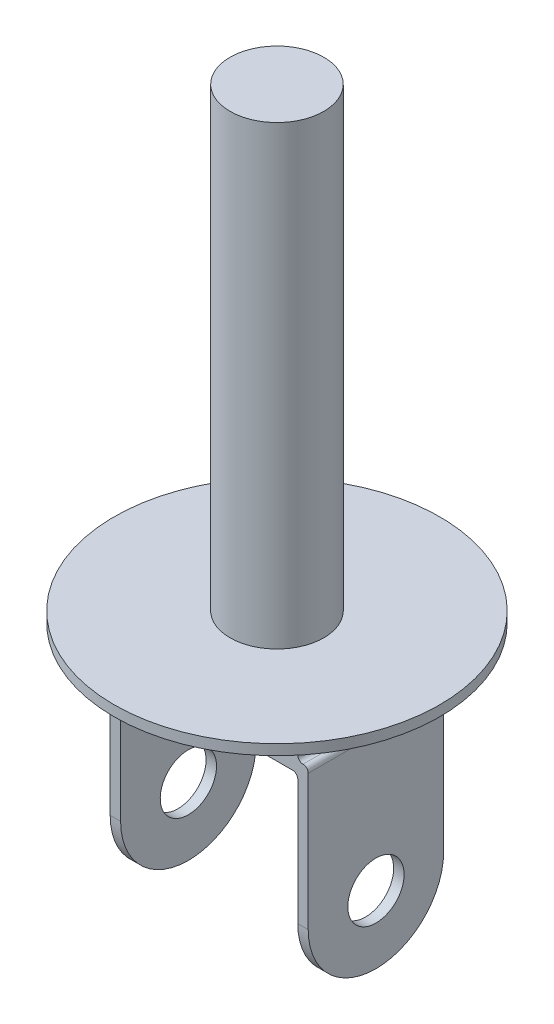
ISO-10303-21;
HEADER;
FILE_DESCRIPTION(('STEP AP214'),'2;1');
FILE_NAME('part.step','',(''),(''),'','','');
FILE_SCHEMA(('AUTOMOTIVE_DESIGN { 1 0 10303 214 1 1 1 1 }'));
ENDSEC;
DATA;
#1=APPLICATION_CONTEXT('core data for automotive mechanical design processes');
#2=APPLICATION_PROTOCOL_DEFINITION('international standard','automotive_design',2000,#1);
#3=PRODUCT_CONTEXT('',#1,'mechanical');
#4=PRODUCT('Part','Part','',(#3));
#5=PRODUCT_RELATED_PRODUCT_CATEGORY('part','',(#4));
#6=PRODUCT_DEFINITION_FORMATION('','',#4);
#7=PRODUCT_DEFINITION_CONTEXT('part definition',#1,'design');
#8=PRODUCT_DEFINITION('design','',#6,#7);
#9=PRODUCT_DEFINITION_SHAPE('','',#8);
#10=(LENGTH_UNIT() NAMED_UNIT(*) SI_UNIT(.MILLI.,.METRE.));
#11=(NAMED_UNIT(*) PLANE_ANGLE_UNIT() SI_UNIT($,.RADIAN.));
#12=(NAMED_UNIT(*) SI_UNIT($,.STERADIAN.) SOLID_ANGLE_UNIT());
#13=UNCERTAINTY_MEASURE_WITH_UNIT(LENGTH_MEASURE(1.E-05),#10,'distance_accuracy_value','');
#14=(GEOMETRIC_REPRESENTATION_CONTEXT(3) GLOBAL_UNCERTAINTY_ASSIGNED_CONTEXT((#13)) GLOBAL_UNIT_ASSIGNED_CONTEXT((#10,
#11,#12)) REPRESENTATION_CONTEXT('',''));
#15=CARTESIAN_POINT('',(0.,0.,0.));
#16=DIRECTION('',(0.,0.,1.));
#17=DIRECTION('',(1.,0.,0.));
#18=AXIS2_PLACEMENT_3D('',#15,#16,#17);
#19=CARTESIAN_POINT('',(-19.,-48.,-13.));
#20=DIRECTION('',(1.,0.,0.));
#21=DIRECTION('',(0.,0.,-1.));
#22=AXIS2_PLACEMENT_3D('',#19,#20,#21);
#23=PLANE('',#22);
#24=CARTESIAN_POINT('',(-19.,-35.,0.));
#25=DIRECTION('',(1.,0.,0.));
#26=DIRECTION('',(0.,0.,-1.));
#27=AXIS2_PLACEMENT_3D('',#24,#25,#26);
#28=CIRCLE('',#27,5.39999999999999);
#29=CARTESIAN_POINT('',(-19.,-35.,-5.39999999999999));
#30=VERTEX_POINT('',#29);
#31=EDGE_CURVE('E485',#30,#30,#28,.T.);
#32=ORIENTED_EDGE('',*,*,#31,.T.);
#33=EDGE_LOOP('',(#32));
#34=FACE_BOUND('',#33,.T.);
#35=DIRECTION('',(0.,1.,0.));
#36=VECTOR('',#35,1.);
#37=CARTESIAN_POINT('',(-19.,-48.,13.));
#38=LINE('',#37,#36);
#39=CARTESIAN_POINT('',(-19.,-35.,13.));
#40=VERTEX_POINT('',#39);
#41=CARTESIAN_POINT('',(-19.,-9.,13.));
#42=VERTEX_POINT('',#41);
#43=EDGE_CURVE('E234',#40,#42,#38,.T.);
#44=ORIENTED_EDGE('',*,*,#43,.T.);
#45=DIRECTION('',(0.,0.,-1.));
#46=VECTOR('',#45,1.);
#47=CARTESIAN_POINT('',(-19.,-9.,-13.));
#48=LINE('',#47,#46);
#49=CARTESIAN_POINT('',(-19.,-9.,-13.));
#50=VERTEX_POINT('',#49);
#51=EDGE_CURVE('E327',#42,#50,#48,.T.);
#52=ORIENTED_EDGE('',*,*,#51,.T.);
#53=DIRECTION('',(0.,1.,0.));
#54=VECTOR('',#53,1.);
#55=CARTESIAN_POINT('',(-19.,-48.,-13.));
#56=LINE('',#55,#54);
#57=CARTESIAN_POINT('',(-19.,-35.,-13.));
#58=VERTEX_POINT('',#57);
#59=EDGE_CURVE('E229',#58,#50,#56,.T.);
#60=ORIENTED_EDGE('',*,*,#59,.F.);
#61=CARTESIAN_POINT('',(-19.,-35.,0.));
#62=DIRECTION('',(1.,0.,0.));
#63=DIRECTION('',(0.,0.,-1.));
#64=AXIS2_PLACEMENT_3D('',#61,#62,#63);
#65=CIRCLE('',#64,13.);
#66=EDGE_CURVE('E437',#40,#58,#65,.T.);
#67=ORIENTED_EDGE('',*,*,#66,.F.);
#68=EDGE_LOOP('',(#44,#52,#60,#67));
#69=FACE_BOUND('',#68,.T.);
#70=ADVANCED_FACE('F46',(#34,#69),#23,.F.);
#71=CARTESIAN_POINT('',(19.,-48.,-13.));
#72=DIRECTION('',(-1.,0.,0.));
#73=DIRECTION('',(0.,0.,1.));
#74=AXIS2_PLACEMENT_3D('',#71,#72,#73);
#75=PLANE('',#74);
#76=CARTESIAN_POINT('',(19.,-35.,0.));
#77=DIRECTION('',(1.,0.,0.));
#78=DIRECTION('',(0.,0.,-1.));
#79=AXIS2_PLACEMENT_3D('',#76,#77,#78);
#80=CIRCLE('',#79,5.4);
#81=CARTESIAN_POINT('',(19.,-35.,-5.4));
#82=VERTEX_POINT('',#81);
#83=EDGE_CURVE('E475',#82,#82,#80,.T.);
#84=ORIENTED_EDGE('',*,*,#83,.F.);
#85=EDGE_LOOP('',(#84));
#86=FACE_BOUND('',#85,.T.);
#87=DIRECTION('',(0.,1.,0.));
#88=VECTOR('',#87,1.);
#89=CARTESIAN_POINT('',(19.,-48.,-13.));
#90=LINE('',#89,#88);
#91=CARTESIAN_POINT('',(19.,-35.,-13.));
#92=VERTEX_POINT('',#91);
#93=CARTESIAN_POINT('',(19.,-9.,-13.));
#94=VERTEX_POINT('',#93);
#95=EDGE_CURVE('E203',#92,#94,#90,.T.);
#96=ORIENTED_EDGE('',*,*,#95,.T.);
#97=DIRECTION('',(0.,0.,-1.));
#98=VECTOR('',#97,1.);
#99=CARTESIAN_POINT('',(19.,-9.,-13.));
#100=LINE('',#99,#98);
#101=CARTESIAN_POINT('',(19.,-9.,13.));
#102=VERTEX_POINT('',#101);
#103=EDGE_CURVE('E292',#94,#102,#100,.F.);
#104=ORIENTED_EDGE('',*,*,#103,.T.);
#105=DIRECTION('',(0.,1.,0.));
#106=VECTOR('',#105,1.);
#107=CARTESIAN_POINT('',(19.,-48.,13.));
#108=LINE('',#107,#106);
#109=CARTESIAN_POINT('',(19.,-35.,13.));
#110=VERTEX_POINT('',#109);
#111=EDGE_CURVE('E206',#110,#102,#108,.T.);
#112=ORIENTED_EDGE('',*,*,#111,.F.);
#113=CARTESIAN_POINT('',(19.,-35.,0.));
#114=DIRECTION('',(1.,0.,0.));
#115=DIRECTION('',(0.,0.,-1.));
#116=AXIS2_PLACEMENT_3D('',#113,#114,#115);
#117=CIRCLE('',#116,13.);
#118=EDGE_CURVE('E198',#110,#92,#117,.T.);
#119=ORIENTED_EDGE('',*,*,#118,.T.);
#120=EDGE_LOOP('',(#96,#104,#112,#119));
#121=FACE_BOUND('',#120,.T.);
#122=ADVANCED_FACE('F200',(#86,#121),#75,.F.);
#123=CARTESIAN_POINT('',(17.,-10.,-35.));
#124=DIRECTION('',(1.,0.,0.));
#125=DIRECTION('',(0.,1.,0.));
#126=AXIS2_PLACEMENT_3D('',#123,#124,#125);
#127=PLANE('',#126);
#128=CARTESIAN_POINT('',(17.,-35.,0.));
#129=DIRECTION('',(1.,0.,0.));
#130=DIRECTION('',(0.,1.,0.));
#131=AXIS2_PLACEMENT_3D('',#128,#129,#130);
#132=CIRCLE('',#131,5.39999999999999);
#133=CARTESIAN_POINT('',(17.,-29.6,0.));
#134=VERTEX_POINT('',#133);
#135=EDGE_CURVE('E211',#134,#134,#132,.T.);
#136=ORIENTED_EDGE('',*,*,#135,.T.);
#137=EDGE_LOOP('',(#136));
#138=FACE_BOUND('',#137,.T.);
#139=DIRECTION('',(0.,1.,0.));
#140=VECTOR('',#139,1.);
#141=CARTESIAN_POINT('',(17.,-10.,13.));
#142=LINE('',#141,#140);
#143=CARTESIAN_POINT('',(17.,-35.,13.));
#144=VERTEX_POINT('',#143);
#145=CARTESIAN_POINT('',(17.,-11.,13.));
#146=VERTEX_POINT('',#145);
#147=EDGE_CURVE('E440',#144,#146,#142,.T.);
#148=ORIENTED_EDGE('',*,*,#147,.T.);
#149=DIRECTION('',(0.,0.,1.));
#150=VECTOR('',#149,1.);
#151=CARTESIAN_POINT('',(17.,-11.,-13.));
#152=LINE('',#151,#150);
#153=CARTESIAN_POINT('',(17.,-11.,-13.));
#154=VERTEX_POINT('',#153);
#155=EDGE_CURVE('E274',#146,#154,#152,.F.);
#156=ORIENTED_EDGE('',*,*,#155,.T.);
#157=DIRECTION('',(0.,1.,0.));
#158=VECTOR('',#157,1.);
#159=CARTESIAN_POINT('',(17.,-48.,-13.));
#160=LINE('',#159,#158);
#161=CARTESIAN_POINT('',(17.,-35.,-13.));
#162=VERTEX_POINT('',#161);
#163=EDGE_CURVE('E458',#162,#154,#160,.T.);
#164=ORIENTED_EDGE('',*,*,#163,.F.);
#165=CARTESIAN_POINT('',(17.,-35.,0.));
#166=DIRECTION('',(1.,0.,0.));
#167=DIRECTION('',(0.,1.,0.));
#168=AXIS2_PLACEMENT_3D('',#165,#166,#167);
#169=CIRCLE('',#168,13.);
#170=EDGE_CURVE('E217',#144,#162,#169,.T.);
#171=ORIENTED_EDGE('',*,*,#170,.F.);
#172=EDGE_LOOP('',(#148,#156,#164,#171));
#173=FACE_BOUND('',#172,.T.);
#174=ADVANCED_FACE('F512',(#138,#173),#127,.F.);
#175=CARTESIAN_POINT('',(-17.,-10.,-35.));
#176=DIRECTION('',(-1.,0.,0.));
#177=DIRECTION('',(0.,-1.,0.));
#178=AXIS2_PLACEMENT_3D('',#175,#176,#177);
#179=PLANE('',#178);
#180=CARTESIAN_POINT('',(-17.,-35.,0.));
#181=DIRECTION('',(-1.,0.,0.));
#182=DIRECTION('',(0.,-1.,0.));
#183=AXIS2_PLACEMENT_3D('',#180,#181,#182);
#184=CIRCLE('',#183,5.39999999999999);
#185=CARTESIAN_POINT('',(-17.,-40.4,0.));
#186=VERTEX_POINT('',#185);
#187=EDGE_CURVE('E481',#186,#186,#184,.T.);
#188=ORIENTED_EDGE('',*,*,#187,.T.);
#189=EDGE_LOOP('',(#188));
#190=FACE_BOUND('',#189,.T.);
#191=DIRECTION('',(0.,-1.,0.));
#192=VECTOR('',#191,1.);
#193=CARTESIAN_POINT('',(-17.,-48.,-13.));
#194=LINE('',#193,#192);
#195=CARTESIAN_POINT('',(-17.,-11.,-13.));
#196=VERTEX_POINT('',#195);
#197=CARTESIAN_POINT('',(-17.,-35.,-13.));
#198=VERTEX_POINT('',#197);
#199=EDGE_CURVE('E431',#196,#198,#194,.T.);
#200=ORIENTED_EDGE('',*,*,#199,.F.);
#201=DIRECTION('',(0.,0.,1.));
#202=VECTOR('',#201,1.);
#203=CARTESIAN_POINT('',(-17.,-11.,13.));
#204=LINE('',#203,#202);
#205=CARTESIAN_POINT('',(-17.,-11.,13.));
#206=VERTEX_POINT('',#205);
#207=EDGE_CURVE('E277',#196,#206,#204,.T.);
#208=ORIENTED_EDGE('',*,*,#207,.T.);
#209=DIRECTION('',(0.,-1.,0.));
#210=VECTOR('',#209,1.);
#211=CARTESIAN_POINT('',(-17.,-10.,13.));
#212=LINE('',#211,#210);
#213=CARTESIAN_POINT('',(-17.,-35.,13.));
#214=VERTEX_POINT('',#213);
#215=EDGE_CURVE('E453',#206,#214,#212,.T.);
#216=ORIENTED_EDGE('',*,*,#215,.T.);
#217=CARTESIAN_POINT('',(-17.,-35.,0.));
#218=DIRECTION('',(-1.,0.,0.));
#219=DIRECTION('',(0.,-1.,0.));
#220=AXIS2_PLACEMENT_3D('',#217,#218,#219);
#221=CIRCLE('',#220,13.);
#222=EDGE_CURVE('E222',#198,#214,#221,.T.);
#223=ORIENTED_EDGE('',*,*,#222,.F.);
#224=EDGE_LOOP('',(#200,#208,#216,#223));
#225=FACE_BOUND('',#224,.T.);
#226=ADVANCED_FACE('F497',(#190,#225),#179,.F.);
#227=CARTESIAN_POINT('',(-19.,-48.,-13.));
#228=DIRECTION('',(0.,0.,1.));
#229=DIRECTION('',(1.,0.,0.));
#230=AXIS2_PLACEMENT_3D('',#227,#228,#229);
#231=PLANE('',#230);
#232=DIRECTION('',(0.,1.,0.));
#233=VECTOR('',#232,1.);
#234=CARTESIAN_POINT('',(17.,-2.,-13.));
#235=LINE('',#234,#233);
#236=CARTESIAN_POINT('',(17.,-7.,-13.));
#237=VERTEX_POINT('',#236);
#238=CARTESIAN_POINT('',(17.,-3.,-13.));
#239=VERTEX_POINT('',#238);
#240=EDGE_CURVE('E471',#237,#239,#235,.T.);
#241=ORIENTED_EDGE('',*,*,#240,.F.);
#242=CARTESIAN_POINT('',(18.,-7.,-13.));
#243=DIRECTION('',(0.,0.,1.));
#244=DIRECTION('',(1.,0.,0.));
#245=AXIS2_PLACEMENT_3D('',#242,#243,#244);
#246=CIRCLE('',#245,1.);
#247=CARTESIAN_POINT('',(18.,-8.,-13.));
#248=VERTEX_POINT('',#247);
#249=EDGE_CURVE('E342',#237,#248,#246,.T.);
#250=ORIENTED_EDGE('',*,*,#249,.T.);
#251=CARTESIAN_POINT('',(18.,-9.,-13.));
#252=DIRECTION('',(0.,0.,1.));
#253=DIRECTION('',(1.,0.,0.));
#254=AXIS2_PLACEMENT_3D('',#251,#252,#253);
#255=CIRCLE('',#254,1.);
#256=EDGE_CURVE('E227',#248,#94,#255,.F.);
#257=ORIENTED_EDGE('',*,*,#256,.T.);
#258=ORIENTED_EDGE('',*,*,#95,.F.);
#259=DIRECTION('',(1.,0.,0.));
#260=VECTOR('',#259,1.);
#261=CARTESIAN_POINT('',(-29.,-35.,-13.));
#262=LINE('',#261,#260);
#263=EDGE_CURVE('E214',#162,#92,#262,.T.);
#264=ORIENTED_EDGE('',*,*,#263,.F.);
#265=ORIENTED_EDGE('',*,*,#163,.T.);
#266=CARTESIAN_POINT('',(16.,-11.,-13.));
#267=DIRECTION('',(0.,0.,1.));
#268=DIRECTION('',(1.,0.,0.));
#269=AXIS2_PLACEMENT_3D('',#266,#267,#268);
#270=CIRCLE('',#269,1.);
#271=CARTESIAN_POINT('',(16.,-10.,-13.));
#272=VERTEX_POINT('',#271);
#273=EDGE_CURVE('E333',#154,#272,#270,.T.);
#274=ORIENTED_EDGE('',*,*,#273,.T.);
#275=DIRECTION('',(-1.,0.,0.));
#276=VECTOR('',#275,1.);
#277=CARTESIAN_POINT('',(-19.,-10.,-13.));
#278=LINE('',#277,#276);
#279=CARTESIAN_POINT('',(-16.,-10.,-13.));
#280=VERTEX_POINT('',#279);
#281=EDGE_CURVE('E249',#272,#280,#278,.T.);
#282=ORIENTED_EDGE('',*,*,#281,.T.);
#283=CARTESIAN_POINT('',(-16.,-11.,-13.));
#284=DIRECTION('',(0.,0.,1.));
#285=DIRECTION('',(1.,0.,0.));
#286=AXIS2_PLACEMENT_3D('',#283,#284,#285);
#287=CIRCLE('',#286,1.);
#288=EDGE_CURVE('E339',#280,#196,#287,.T.);
#289=ORIENTED_EDGE('',*,*,#288,.T.);
#290=ORIENTED_EDGE('',*,*,#199,.T.);
#291=EDGE_CURVE('E221',#58,#198,#262,.T.);
#292=ORIENTED_EDGE('',*,*,#291,.F.);
#293=ORIENTED_EDGE('',*,*,#59,.T.);
#294=CARTESIAN_POINT('',(-18.,-9.,-13.));
#295=DIRECTION('',(0.,0.,1.));
#296=DIRECTION('',(1.,0.,0.));
#297=AXIS2_PLACEMENT_3D('',#294,#295,#296);
#298=CIRCLE('',#297,1.);
#299=CARTESIAN_POINT('',(-18.,-8.,-13.));
#300=VERTEX_POINT('',#299);
#301=EDGE_CURVE('E281',#50,#300,#298,.F.);
#302=ORIENTED_EDGE('',*,*,#301,.T.);
#303=CARTESIAN_POINT('',(-18.,-7.,-13.));
#304=DIRECTION('',(0.,0.,1.));
#305=DIRECTION('',(1.,0.,0.));
#306=AXIS2_PLACEMENT_3D('',#303,#304,#305);
#307=CIRCLE('',#306,1.);
#308=CARTESIAN_POINT('',(-17.,-7.,-13.));
#309=VERTEX_POINT('',#308);
#310=EDGE_CURVE('E372',#300,#309,#307,.T.);
#311=ORIENTED_EDGE('',*,*,#310,.T.);
#312=DIRECTION('',(0.,-1.,0.));
#313=VECTOR('',#312,1.);
#314=CARTESIAN_POINT('',(-17.,-2.,-13.));
#315=LINE('',#314,#313);
#316=CARTESIAN_POINT('',(-17.,-3.,-13.));
#317=VERTEX_POINT('',#316);
#318=EDGE_CURVE('E381',#317,#309,#315,.T.);
#319=ORIENTED_EDGE('',*,*,#318,.F.);
#320=CARTESIAN_POINT('',(-18.,-3.,-13.));
#321=DIRECTION('',(0.,0.,1.));
#322=DIRECTION('',(1.,0.,0.));
#323=AXIS2_PLACEMENT_3D('',#320,#321,#322);
#324=CIRCLE('',#323,1.);
#325=CARTESIAN_POINT('',(-18.,-2.,-13.));
#326=VERTEX_POINT('',#325);
#327=EDGE_CURVE('E366',#317,#326,#324,.T.);
#328=ORIENTED_EDGE('',*,*,#327,.T.);
#329=CARTESIAN_POINT('',(-18.,-1.,-13.));
#330=DIRECTION('',(0.,0.,1.));
#331=DIRECTION('',(1.,0.,0.));
#332=AXIS2_PLACEMENT_3D('',#329,#330,#331);
#333=CIRCLE('',#332,1.);
#334=CARTESIAN_POINT('',(-19.,-1.,-13.));
#335=VERTEX_POINT('',#334);
#336=EDGE_CURVE('E284',#326,#335,#333,.F.);
#337=ORIENTED_EDGE('',*,*,#336,.T.);
#338=CARTESIAN_POINT('',(-20.,-1.,-13.));
#339=DIRECTION('',(0.,0.,1.));
#340=DIRECTION('',(1.,0.,0.));
#341=AXIS2_PLACEMENT_3D('',#338,#339,#340);
#342=CIRCLE('',#341,1.);
#343=CARTESIAN_POINT('',(-20.,0.,-13.));
#344=VERTEX_POINT('',#343);
#345=EDGE_CURVE('E360',#335,#344,#342,.T.);
#346=ORIENTED_EDGE('',*,*,#345,.T.);
#347=DIRECTION('',(1.,0.,0.));
#348=VECTOR('',#347,1.);
#349=CARTESIAN_POINT('',(-19.,0.,-13.));
#350=LINE('',#349,#348);
#351=CARTESIAN_POINT('',(20.,0.,-13.));
#352=VERTEX_POINT('',#351);
#353=EDGE_CURVE('E72',#344,#352,#350,.T.);
#354=ORIENTED_EDGE('',*,*,#353,.T.);
#355=CARTESIAN_POINT('',(20.,-1.,-13.));
#356=DIRECTION('',(0.,0.,1.));
#357=DIRECTION('',(1.,0.,0.));
#358=AXIS2_PLACEMENT_3D('',#355,#356,#357);
#359=CIRCLE('',#358,1.);
#360=CARTESIAN_POINT('',(19.,-1.,-13.));
#361=VERTEX_POINT('',#360);
#362=EDGE_CURVE('E357',#352,#361,#359,.T.);
#363=ORIENTED_EDGE('',*,*,#362,.T.);
#364=CARTESIAN_POINT('',(18.,-1.,-13.));
#365=DIRECTION('',(0.,0.,1.));
#366=DIRECTION('',(1.,0.,0.));
#367=AXIS2_PLACEMENT_3D('',#364,#365,#366);
#368=CIRCLE('',#367,1.);
#369=CARTESIAN_POINT('',(18.,-2.,-13.));
#370=VERTEX_POINT('',#369);
#371=EDGE_CURVE('E287',#361,#370,#368,.F.);
#372=ORIENTED_EDGE('',*,*,#371,.T.);
#373=CARTESIAN_POINT('',(18.,-3.,-13.));
#374=DIRECTION('',(0.,0.,1.));
#375=DIRECTION('',(1.,0.,0.));
#376=AXIS2_PLACEMENT_3D('',#373,#374,#375);
#377=CIRCLE('',#376,1.);
#378=EDGE_CURVE('E348',#370,#239,#377,.T.);
#379=ORIENTED_EDGE('',*,*,#378,.T.);
#380=EDGE_LOOP('',(#241,#250,#257,#258,#264,#265,#274,#282,#289,#290,#292,#293,#302,#311,#319,
#328,#337,#346,#354,#363,#372,#379));
#381=FACE_BOUND('',#380,.T.);
#382=ADVANCED_FACE('F225',(#381),#231,.F.);
#383=CARTESIAN_POINT('',(0.,0.,0.));
#384=DIRECTION('',(0.,1.,0.));
#385=DIRECTION('',(0.,0.,1.));
#386=AXIS2_PLACEMENT_3D('',#383,#384,#385);
#387=PLANE('',#386);
#388=CARTESIAN_POINT('',(0.,0.,0.));
#389=DIRECTION('',(0.,1.,0.));
#390=DIRECTION('',(0.,0.,1.));
#391=AXIS2_PLACEMENT_3D('',#388,#389,#390);
#392=CIRCLE('',#391,31.25);
#393=CARTESIAN_POINT('',(0.,0.,31.25));
#394=VERTEX_POINT('',#393);
#395=EDGE_CURVE('E244',#394,#394,#392,.T.);
#396=ORIENTED_EDGE('',*,*,#395,.F.);
#397=EDGE_LOOP('',(#396));
#398=FACE_BOUND('',#397,.T.);
#399=DIRECTION('',(-1.,0.,0.));
#400=VECTOR('',#399,1.);
#401=CARTESIAN_POINT('',(-19.,0.,13.));
#402=LINE('',#401,#400);
#403=CARTESIAN_POINT('',(20.,0.,13.));
#404=VERTEX_POINT('',#403);
#405=CARTESIAN_POINT('',(-20.,0.,13.));
#406=VERTEX_POINT('',#405);
#407=EDGE_CURVE('E64',#404,#406,#402,.T.);
#408=ORIENTED_EDGE('',*,*,#407,.F.);
#409=DIRECTION('',(0.,0.,1.));
#410=VECTOR('',#409,1.);
#411=CARTESIAN_POINT('',(20.,0.,-13.));
#412=LINE('',#411,#410);
#413=EDGE_CURVE('E317',#404,#352,#412,.F.);
#414=ORIENTED_EDGE('',*,*,#413,.T.);
#415=ORIENTED_EDGE('',*,*,#353,.F.);
#416=DIRECTION('',(0.,0.,-1.));
#417=VECTOR('',#416,1.);
#418=CARTESIAN_POINT('',(-20.,0.,13.));
#419=LINE('',#418,#417);
#420=EDGE_CURVE('E314',#344,#406,#419,.F.);
#421=ORIENTED_EDGE('',*,*,#420,.T.);
#422=EDGE_LOOP('',(#408,#414,#415,#421));
#423=FACE_BOUND('',#422,.T.);
#424=ADVANCED_FACE('F468',(#398,#423),#387,.F.);
#425=CARTESIAN_POINT('',(0.,2.,0.));
#426=DIRECTION('',(0.,-1.,0.));
#427=DIRECTION('',(0.,0.,-1.));
#428=AXIS2_PLACEMENT_3D('',#425,#426,#427);
#429=CYLINDRICAL_SURFACE('',#428,31.25);
#430=CARTESIAN_POINT('',(0.,2.,0.));
#431=DIRECTION('',(0.,1.,0.));
#432=DIRECTION('',(0.,0.,1.));
#433=AXIS2_PLACEMENT_3D('',#430,#431,#432);
#434=CIRCLE('',#433,31.25);
#435=CARTESIAN_POINT('',(0.,2.,31.25));
#436=VERTEX_POINT('',#435);
#437=EDGE_CURVE('E245',#436,#436,#434,.T.);
#438=ORIENTED_EDGE('',*,*,#437,.F.);
#439=EDGE_LOOP('',(#438));
#440=FACE_BOUND('',#439,.T.);
#441=ORIENTED_EDGE('',*,*,#395,.T.);
#442=EDGE_LOOP('',(#441));
#443=FACE_BOUND('',#442,.T.);
#444=ADVANCED_FACE('F537',(#440,#443),#429,.T.);
#445=CARTESIAN_POINT('',(0.,2.,0.));
#446=DIRECTION('',(0.,1.,0.));
#447=DIRECTION('',(0.,0.,1.));
#448=AXIS2_PLACEMENT_3D('',#445,#446,#447);
#449=PLANE('',#448);
#450=CARTESIAN_POINT('',(0.,2.,0.));
#451=DIRECTION('',(0.,1.,0.));
#452=DIRECTION('',(0.,0.,1.));
#453=AXIS2_PLACEMENT_3D('',#450,#451,#452);
#454=CIRCLE('',#453,9.);
#455=CARTESIAN_POINT('',(0.,2.,9.));
#456=VERTEX_POINT('',#455);
#457=EDGE_CURVE('E11',#456,#456,#454,.T.);
#458=ORIENTED_EDGE('',*,*,#457,.F.);
#459=EDGE_LOOP('',(#458));
#460=FACE_BOUND('',#459,.T.);
#461=ORIENTED_EDGE('',*,*,#437,.T.);
#462=EDGE_LOOP('',(#461));
#463=FACE_BOUND('',#462,.T.);
#464=ADVANCED_FACE('F533',(#460,#463),#449,.T.);
#465=CARTESIAN_POINT('',(-19.,-48.,13.));
#466=DIRECTION('',(0.,0.,-1.));
#467=DIRECTION('',(-1.,0.,0.));
#468=AXIS2_PLACEMENT_3D('',#465,#466,#467);
#469=PLANE('',#468);
#470=ORIENTED_EDGE('',*,*,#111,.T.);
#471=CARTESIAN_POINT('',(18.,-9.,13.));
#472=DIRECTION('',(0.,0.,-1.));
#473=DIRECTION('',(-1.,0.,0.));
#474=AXIS2_PLACEMENT_3D('',#471,#472,#473);
#475=CIRCLE('',#474,1.);
#476=CARTESIAN_POINT('',(18.,-8.,13.));
#477=VERTEX_POINT('',#476);
#478=EDGE_CURVE('E304',#102,#477,#475,.F.);
#479=ORIENTED_EDGE('',*,*,#478,.T.);
#480=CARTESIAN_POINT('',(18.,-7.,13.));
#481=DIRECTION('',(0.,0.,-1.));
#482=DIRECTION('',(-1.,0.,0.));
#483=AXIS2_PLACEMENT_3D('',#480,#481,#482);
#484=CIRCLE('',#483,1.);
#485=CARTESIAN_POINT('',(17.,-7.,13.));
#486=VERTEX_POINT('',#485);
#487=EDGE_CURVE('E345',#477,#486,#484,.T.);
#488=ORIENTED_EDGE('',*,*,#487,.T.);
#489=DIRECTION('',(0.,1.,0.));
#490=VECTOR('',#489,1.);
#491=CARTESIAN_POINT('',(17.,-48.,13.));
#492=LINE('',#491,#490);
#493=CARTESIAN_POINT('',(17.,-3.,13.));
#494=VERTEX_POINT('',#493);
#495=EDGE_CURVE('E263',#486,#494,#492,.T.);
#496=ORIENTED_EDGE('',*,*,#495,.T.);
#497=CARTESIAN_POINT('',(18.,-3.,13.));
#498=DIRECTION('',(0.,0.,-1.));
#499=DIRECTION('',(-1.,0.,0.));
#500=AXIS2_PLACEMENT_3D('',#497,#498,#499);
#501=CIRCLE('',#500,1.);
#502=CARTESIAN_POINT('',(18.,-2.,13.));
#503=VERTEX_POINT('',#502);
#504=EDGE_CURVE('E351',#494,#503,#501,.T.);
#505=ORIENTED_EDGE('',*,*,#504,.T.);
#506=CARTESIAN_POINT('',(18.,-1.,13.));
#507=DIRECTION('',(0.,0.,-1.));
#508=DIRECTION('',(-1.,0.,0.));
#509=AXIS2_PLACEMENT_3D('',#506,#507,#508);
#510=CIRCLE('',#509,1.);
#511=CARTESIAN_POINT('',(19.,-1.,13.));
#512=VERTEX_POINT('',#511);
#513=EDGE_CURVE('E301',#503,#512,#510,.F.);
#514=ORIENTED_EDGE('',*,*,#513,.T.);
#515=CARTESIAN_POINT('',(20.,-1.,13.));
#516=DIRECTION('',(0.,0.,-1.));
#517=DIRECTION('',(-1.,0.,0.));
#518=AXIS2_PLACEMENT_3D('',#515,#516,#517);
#519=CIRCLE('',#518,1.);
#520=EDGE_CURVE('E354',#512,#404,#519,.T.);
#521=ORIENTED_EDGE('',*,*,#520,.T.);
#522=ORIENTED_EDGE('',*,*,#407,.T.);
#523=CARTESIAN_POINT('',(-20.,-1.,13.));
#524=DIRECTION('',(0.,0.,-1.));
#525=DIRECTION('',(-1.,0.,0.));
#526=AXIS2_PLACEMENT_3D('',#523,#524,#525);
#527=CIRCLE('',#526,1.);
#528=CARTESIAN_POINT('',(-19.,-1.,13.));
#529=VERTEX_POINT('',#528);
#530=EDGE_CURVE('E363',#406,#529,#527,.T.);
#531=ORIENTED_EDGE('',*,*,#530,.T.);
#532=CARTESIAN_POINT('',(-18.,-1.,13.));
#533=DIRECTION('',(0.,0.,-1.));
#534=DIRECTION('',(-1.,0.,0.));
#535=AXIS2_PLACEMENT_3D('',#532,#533,#534);
#536=CIRCLE('',#535,1.);
#537=CARTESIAN_POINT('',(-18.,-2.,13.));
#538=VERTEX_POINT('',#537);
#539=EDGE_CURVE('E298',#529,#538,#536,.F.);
#540=ORIENTED_EDGE('',*,*,#539,.T.);
#541=CARTESIAN_POINT('',(-18.,-3.,13.));
#542=DIRECTION('',(0.,0.,-1.));
#543=DIRECTION('',(-1.,0.,0.));
#544=AXIS2_PLACEMENT_3D('',#541,#542,#543);
#545=CIRCLE('',#544,1.);
#546=CARTESIAN_POINT('',(-17.,-3.,13.));
#547=VERTEX_POINT('',#546);
#548=EDGE_CURVE('E369',#538,#547,#545,.T.);
#549=ORIENTED_EDGE('',*,*,#548,.T.);
#550=DIRECTION('',(0.,-1.,0.));
#551=VECTOR('',#550,1.);
#552=CARTESIAN_POINT('',(-17.,-48.,13.));
#553=LINE('',#552,#551);
#554=CARTESIAN_POINT('',(-17.,-7.,13.));
#555=VERTEX_POINT('',#554);
#556=EDGE_CURVE('E259',#547,#555,#553,.T.);
#557=ORIENTED_EDGE('',*,*,#556,.T.);
#558=CARTESIAN_POINT('',(-18.,-7.,13.));
#559=DIRECTION('',(0.,0.,-1.));
#560=DIRECTION('',(-1.,0.,0.));
#561=AXIS2_PLACEMENT_3D('',#558,#559,#560);
#562=CIRCLE('',#561,1.);
#563=CARTESIAN_POINT('',(-18.,-8.,13.));
#564=VERTEX_POINT('',#563);
#565=EDGE_CURVE('E56',#555,#564,#562,.T.);
#566=ORIENTED_EDGE('',*,*,#565,.T.);
#567=CARTESIAN_POINT('',(-18.,-9.,13.));
#568=DIRECTION('',(0.,0.,-1.));
#569=DIRECTION('',(-1.,0.,0.));
#570=AXIS2_PLACEMENT_3D('',#567,#568,#569);
#571=CIRCLE('',#570,1.);
#572=EDGE_CURVE('E295',#564,#42,#571,.F.);
#573=ORIENTED_EDGE('',*,*,#572,.T.);
#574=ORIENTED_EDGE('',*,*,#43,.F.);
#575=DIRECTION('',(1.,0.,0.));
#576=VECTOR('',#575,1.);
#577=CARTESIAN_POINT('',(-29.,-35.,13.));
#578=LINE('',#577,#576);
#579=EDGE_CURVE('E438',#40,#214,#578,.T.);
#580=ORIENTED_EDGE('',*,*,#579,.T.);
#581=ORIENTED_EDGE('',*,*,#215,.F.);
#582=CARTESIAN_POINT('',(-16.,-11.,13.));
#583=DIRECTION('',(0.,0.,-1.));
#584=DIRECTION('',(-1.,0.,0.));
#585=AXIS2_PLACEMENT_3D('',#582,#583,#584);
#586=CIRCLE('',#585,1.);
#587=CARTESIAN_POINT('',(-16.,-10.,13.));
#588=VERTEX_POINT('',#587);
#589=EDGE_CURVE('E336',#206,#588,#586,.T.);
#590=ORIENTED_EDGE('',*,*,#589,.T.);
#591=DIRECTION('',(-1.,0.,0.));
#592=VECTOR('',#591,1.);
#593=CARTESIAN_POINT('',(-17.,-10.,13.));
#594=LINE('',#593,#592);
#595=CARTESIAN_POINT('',(16.,-10.,13.));
#596=VERTEX_POINT('',#595);
#597=EDGE_CURVE('E445',#596,#588,#594,.T.);
#598=ORIENTED_EDGE('',*,*,#597,.F.);
#599=CARTESIAN_POINT('',(16.,-11.,13.));
#600=DIRECTION('',(0.,0.,-1.));
#601=DIRECTION('',(-1.,0.,0.));
#602=AXIS2_PLACEMENT_3D('',#599,#600,#601);
#603=CIRCLE('',#602,1.);
#604=EDGE_CURVE('E330',#596,#146,#603,.T.);
#605=ORIENTED_EDGE('',*,*,#604,.T.);
#606=ORIENTED_EDGE('',*,*,#147,.F.);
#607=EDGE_CURVE('E210',#144,#110,#578,.T.);
#608=ORIENTED_EDGE('',*,*,#607,.T.);
#609=EDGE_LOOP('',(#470,#479,#488,#496,#505,#514,#521,#522,#531,#540,#549,#557,#566,#573,#574,
#580,#581,#590,#598,#605,#606,#608));
#610=FACE_BOUND('',#609,.T.);
#611=ADVANCED_FACE('F409',(#610),#469,.F.);
#612=CARTESIAN_POINT('',(-17.,-10.,-35.));
#613=DIRECTION('',(0.,1.,0.));
#614=DIRECTION('',(0.,0.,1.));
#615=AXIS2_PLACEMENT_3D('',#612,#613,#614);
#616=PLANE('',#615);
#617=ORIENTED_EDGE('',*,*,#281,.F.);
#618=DIRECTION('',(0.,0.,1.));
#619=VECTOR('',#618,1.);
#620=CARTESIAN_POINT('',(16.,-10.,13.));
#621=LINE('',#620,#619);
#622=EDGE_CURVE('E270',#272,#596,#621,.T.);
#623=ORIENTED_EDGE('',*,*,#622,.T.);
#624=ORIENTED_EDGE('',*,*,#597,.T.);
#625=DIRECTION('',(0.,0.,1.));
#626=VECTOR('',#625,1.);
#627=CARTESIAN_POINT('',(-16.,-10.,-13.));
#628=LINE('',#627,#626);
#629=EDGE_CURVE('E267',#588,#280,#628,.F.);
#630=ORIENTED_EDGE('',*,*,#629,.T.);
#631=EDGE_LOOP('',(#617,#623,#624,#630));
#632=FACE_BOUND('',#631,.T.);
#633=ADVANCED_FACE('F505',(#632),#616,.F.);
#634=CARTESIAN_POINT('',(-29.,-35.,0.));
#635=DIRECTION('',(1.,0.,0.));
#636=DIRECTION('',(0.,0.,-1.));
#637=AXIS2_PLACEMENT_3D('',#634,#635,#636);
#638=CYLINDRICAL_SURFACE('',#637,13.);
#639=ORIENTED_EDGE('',*,*,#66,.T.);
#640=ORIENTED_EDGE('',*,*,#291,.T.);
#641=ORIENTED_EDGE('',*,*,#222,.T.);
#642=ORIENTED_EDGE('',*,*,#579,.F.);
#643=EDGE_LOOP('',(#639,#640,#641,#642));
#644=FACE_BOUND('',#643,.T.);
#645=ADVANCED_FACE('F435',(#644),#638,.T.);
#646=ORIENTED_EDGE('',*,*,#170,.T.);
#647=ORIENTED_EDGE('',*,*,#263,.T.);
#648=ORIENTED_EDGE('',*,*,#118,.F.);
#649=ORIENTED_EDGE('',*,*,#607,.F.);
#650=EDGE_LOOP('',(#646,#647,#648,#649));
#651=FACE_BOUND('',#650,.T.);
#652=ADVANCED_FACE('F215',(#651),#638,.T.);
#653=CARTESIAN_POINT('',(19.,-35.,0.));
#654=DIRECTION('',(1.,0.,0.));
#655=DIRECTION('',(0.,0.,-1.));
#656=AXIS2_PLACEMENT_3D('',#653,#654,#655);
#657=CYLINDRICAL_SURFACE('',#656,5.39999999999999);
#658=ORIENTED_EDGE('',*,*,#83,.T.);
#659=EDGE_LOOP('',(#658));
#660=FACE_BOUND('',#659,.T.);
#661=ORIENTED_EDGE('',*,*,#135,.F.);
#662=EDGE_LOOP('',(#661));
#663=FACE_BOUND('',#662,.T.);
#664=ADVANCED_FACE('F647',(#660,#663),#657,.F.);
#665=ORIENTED_EDGE('',*,*,#187,.F.);
#666=EDGE_LOOP('',(#665));
#667=FACE_BOUND('',#666,.T.);
#668=ORIENTED_EDGE('',*,*,#31,.F.);
#669=EDGE_LOOP('',(#668));
#670=FACE_BOUND('',#669,.T.);
#671=ADVANCED_FACE('F639',(#667,#670),#657,.F.);
#672=CARTESIAN_POINT('',(-17.,-2.,35.));
#673=DIRECTION('',(1.,0.,0.));
#674=DIRECTION('',(0.,0.,-1.));
#675=AXIS2_PLACEMENT_3D('',#672,#673,#674);
#676=PLANE('',#675);
#677=ORIENTED_EDGE('',*,*,#556,.F.);
#678=DIRECTION('',(0.,0.,-1.));
#679=VECTOR('',#678,1.);
#680=CARTESIAN_POINT('',(-17.,-3.,-13.));
#681=LINE('',#680,#679);
#682=EDGE_CURVE('E324',#547,#317,#681,.T.);
#683=ORIENTED_EDGE('',*,*,#682,.T.);
#684=ORIENTED_EDGE('',*,*,#318,.T.);
#685=DIRECTION('',(0.,0.,-1.));
#686=VECTOR('',#685,1.);
#687=CARTESIAN_POINT('',(-17.,-7.,13.));
#688=LINE('',#687,#686);
#689=EDGE_CURVE('E320',#309,#555,#688,.F.);
#690=ORIENTED_EDGE('',*,*,#689,.T.);
#691=EDGE_LOOP('',(#677,#683,#684,#690));
#692=FACE_BOUND('',#691,.T.);
#693=ADVANCED_FACE('F411',(#692),#676,.F.);
#694=CARTESIAN_POINT('',(17.,-2.,35.));
#695=DIRECTION('',(-1.,0.,0.));
#696=DIRECTION('',(0.,0.,1.));
#697=AXIS2_PLACEMENT_3D('',#694,#695,#696);
#698=PLANE('',#697);
#699=ORIENTED_EDGE('',*,*,#495,.F.);
#700=DIRECTION('',(0.,0.,-1.));
#701=VECTOR('',#700,1.);
#702=CARTESIAN_POINT('',(17.,-7.,-13.));
#703=LINE('',#702,#701);
#704=EDGE_CURVE('E311',#486,#237,#703,.T.);
#705=ORIENTED_EDGE('',*,*,#704,.T.);
#706=ORIENTED_EDGE('',*,*,#240,.T.);
#707=DIRECTION('',(0.,0.,-1.));
#708=VECTOR('',#707,1.);
#709=CARTESIAN_POINT('',(17.,-3.,13.));
#710=LINE('',#709,#708);
#711=EDGE_CURVE('E307',#239,#494,#710,.F.);
#712=ORIENTED_EDGE('',*,*,#711,.T.);
#713=EDGE_LOOP('',(#699,#705,#706,#712));
#714=FACE_BOUND('',#713,.T.);
#715=ADVANCED_FACE('F547',(#714),#698,.F.);
#716=CARTESIAN_POINT('',(16.,-11.,-35.));
#717=DIRECTION('',(0.,0.,-1.));
#718=DIRECTION('',(-1.,0.,0.));
#719=AXIS2_PLACEMENT_3D('',#716,#717,#718);
#720=CYLINDRICAL_SURFACE('',#719,1.);
#721=ORIENTED_EDGE('',*,*,#273,.F.);
#722=ORIENTED_EDGE('',*,*,#155,.F.);
#723=ORIENTED_EDGE('',*,*,#604,.F.);
#724=ORIENTED_EDGE('',*,*,#622,.F.);
#725=EDGE_LOOP('',(#721,#722,#723,#724));
#726=FACE_BOUND('',#725,.T.);
#727=ADVANCED_FACE('F510',(#726),#720,.F.);
#728=CARTESIAN_POINT('',(-16.,-11.,-35.));
#729=DIRECTION('',(0.,0.,-1.));
#730=DIRECTION('',(-1.,0.,0.));
#731=AXIS2_PLACEMENT_3D('',#728,#729,#730);
#732=CYLINDRICAL_SURFACE('',#731,1.);
#733=ORIENTED_EDGE('',*,*,#288,.F.);
#734=ORIENTED_EDGE('',*,*,#629,.F.);
#735=ORIENTED_EDGE('',*,*,#589,.F.);
#736=ORIENTED_EDGE('',*,*,#207,.F.);
#737=EDGE_LOOP('',(#733,#734,#735,#736));
#738=FACE_BOUND('',#737,.T.);
#739=ADVANCED_FACE('F501',(#738),#732,.F.);
#740=CARTESIAN_POINT('',(18.,-7.,35.));
#741=DIRECTION('',(0.,0.,1.));
#742=DIRECTION('',(1.,0.,0.));
#743=AXIS2_PLACEMENT_3D('',#740,#741,#742);
#744=CYLINDRICAL_SURFACE('',#743,1.);
#745=ORIENTED_EDGE('',*,*,#704,.F.);
#746=ORIENTED_EDGE('',*,*,#487,.F.);
#747=DIRECTION('',(0.,0.,-1.));
#748=VECTOR('',#747,1.);
#749=CARTESIAN_POINT('',(18.,-8.,13.));
#750=LINE('',#749,#748);
#751=EDGE_CURVE('E377',#248,#477,#750,.F.);
#752=ORIENTED_EDGE('',*,*,#751,.F.);
#753=ORIENTED_EDGE('',*,*,#249,.F.);
#754=EDGE_LOOP('',(#745,#746,#752,#753));
#755=FACE_BOUND('',#754,.T.);
#756=ADVANCED_FACE('F550',(#755),#744,.F.);
#757=CARTESIAN_POINT('',(18.,-9.,35.));
#758=DIRECTION('',(0.,0.,-1.));
#759=DIRECTION('',(-1.,0.,0.));
#760=AXIS2_PLACEMENT_3D('',#757,#758,#759);
#761=CYLINDRICAL_SURFACE('',#760,1.);
#762=ORIENTED_EDGE('',*,*,#478,.F.);
#763=ORIENTED_EDGE('',*,*,#103,.F.);
#764=ORIENTED_EDGE('',*,*,#256,.F.);
#765=ORIENTED_EDGE('',*,*,#751,.T.);
#766=EDGE_LOOP('',(#762,#763,#764,#765));
#767=FACE_BOUND('',#766,.T.);
#768=ADVANCED_FACE('F551',(#767),#761,.T.);
#769=CARTESIAN_POINT('',(20.,-1.,-13.));
#770=DIRECTION('',(0.,0.,-1.));
#771=DIRECTION('',(-1.,0.,0.));
#772=AXIS2_PLACEMENT_3D('',#769,#770,#771);
#773=CYLINDRICAL_SURFACE('',#772,1.);
#774=ORIENTED_EDGE('',*,*,#413,.F.);
#775=ORIENTED_EDGE('',*,*,#520,.F.);
#776=DIRECTION('',(0.,0.,1.));
#777=VECTOR('',#776,1.);
#778=CARTESIAN_POINT('',(19.,-1.,13.));
#779=LINE('',#778,#777);
#780=EDGE_CURVE('E382',#361,#512,#779,.T.);
#781=ORIENTED_EDGE('',*,*,#780,.F.);
#782=ORIENTED_EDGE('',*,*,#362,.F.);
#783=EDGE_LOOP('',(#774,#775,#781,#782));
#784=FACE_BOUND('',#783,.T.);
#785=ADVANCED_FACE('F554',(#784),#773,.F.);
#786=CARTESIAN_POINT('',(18.,-1.,-13.));
#787=DIRECTION('',(0.,0.,-1.));
#788=DIRECTION('',(-1.,0.,0.));
#789=AXIS2_PLACEMENT_3D('',#786,#787,#788);
#790=CYLINDRICAL_SURFACE('',#789,1.);
#791=ORIENTED_EDGE('',*,*,#780,.T.);
#792=ORIENTED_EDGE('',*,*,#513,.F.);
#793=DIRECTION('',(0.,0.,-1.));
#794=VECTOR('',#793,1.);
#795=CARTESIAN_POINT('',(18.,-2.,35.));
#796=LINE('',#795,#794);
#797=EDGE_CURVE('E383',#370,#503,#796,.F.);
#798=ORIENTED_EDGE('',*,*,#797,.F.);
#799=ORIENTED_EDGE('',*,*,#371,.F.);
#800=EDGE_LOOP('',(#791,#792,#798,#799));
#801=FACE_BOUND('',#800,.T.);
#802=ADVANCED_FACE('F562',(#801),#790,.T.);
#803=CARTESIAN_POINT('',(18.,-3.,35.));
#804=DIRECTION('',(0.,0.,1.));
#805=DIRECTION('',(1.,0.,0.));
#806=AXIS2_PLACEMENT_3D('',#803,#804,#805);
#807=CYLINDRICAL_SURFACE('',#806,1.);
#808=ORIENTED_EDGE('',*,*,#504,.F.);
#809=ORIENTED_EDGE('',*,*,#711,.F.);
#810=ORIENTED_EDGE('',*,*,#378,.F.);
#811=ORIENTED_EDGE('',*,*,#797,.T.);
#812=EDGE_LOOP('',(#808,#809,#810,#811));
#813=FACE_BOUND('',#812,.T.);
#814=ADVANCED_FACE('F559',(#813),#807,.F.);
#815=CARTESIAN_POINT('',(-18.,-3.,35.));
#816=DIRECTION('',(0.,0.,1.));
#817=DIRECTION('',(1.,0.,0.));
#818=AXIS2_PLACEMENT_3D('',#815,#816,#817);
#819=CYLINDRICAL_SURFACE('',#818,1.);
#820=ORIENTED_EDGE('',*,*,#682,.F.);
#821=ORIENTED_EDGE('',*,*,#548,.F.);
#822=DIRECTION('',(0.,0.,-1.));
#823=VECTOR('',#822,1.);
#824=CARTESIAN_POINT('',(-18.,-2.,13.));
#825=LINE('',#824,#823);
#826=EDGE_CURVE('E387',#326,#538,#825,.F.);
#827=ORIENTED_EDGE('',*,*,#826,.F.);
#828=ORIENTED_EDGE('',*,*,#327,.F.);
#829=EDGE_LOOP('',(#820,#821,#827,#828));
#830=FACE_BOUND('',#829,.T.);
#831=ADVANCED_FACE('F406',(#830),#819,.F.);
#832=CARTESIAN_POINT('',(-18.,-1.,35.));
#833=DIRECTION('',(0.,0.,-1.));
#834=DIRECTION('',(-1.,0.,0.));
#835=AXIS2_PLACEMENT_3D('',#832,#833,#834);
#836=CYLINDRICAL_SURFACE('',#835,1.);
#837=ORIENTED_EDGE('',*,*,#826,.T.);
#838=ORIENTED_EDGE('',*,*,#539,.F.);
#839=DIRECTION('',(0.,0.,-1.));
#840=VECTOR('',#839,1.);
#841=CARTESIAN_POINT('',(-19.,-1.,-13.));
#842=LINE('',#841,#840);
#843=EDGE_CURVE('E391',#335,#529,#842,.F.);
#844=ORIENTED_EDGE('',*,*,#843,.F.);
#845=ORIENTED_EDGE('',*,*,#336,.F.);
#846=EDGE_LOOP('',(#837,#838,#844,#845));
#847=FACE_BOUND('',#846,.T.);
#848=ADVANCED_FACE('F400',(#847),#836,.T.);
#849=CARTESIAN_POINT('',(-20.,-1.,-13.));
#850=DIRECTION('',(0.,0.,1.));
#851=DIRECTION('',(1.,0.,0.));
#852=AXIS2_PLACEMENT_3D('',#849,#850,#851);
#853=CYLINDRICAL_SURFACE('',#852,1.);
#854=ORIENTED_EDGE('',*,*,#530,.F.);
#855=ORIENTED_EDGE('',*,*,#420,.F.);
#856=ORIENTED_EDGE('',*,*,#345,.F.);
#857=ORIENTED_EDGE('',*,*,#843,.T.);
#858=EDGE_LOOP('',(#854,#855,#856,#857));
#859=FACE_BOUND('',#858,.T.);
#860=ADVANCED_FACE('F466',(#859),#853,.F.);
#861=CARTESIAN_POINT('',(-18.,-9.,-13.));
#862=DIRECTION('',(0.,0.,-1.));
#863=DIRECTION('',(-1.,0.,0.));
#864=AXIS2_PLACEMENT_3D('',#861,#862,#863);
#865=CYLINDRICAL_SURFACE('',#864,1.);
#866=ORIENTED_EDGE('',*,*,#51,.F.);
#867=ORIENTED_EDGE('',*,*,#572,.F.);
#868=DIRECTION('',(0.,0.,-1.));
#869=VECTOR('',#868,1.);
#870=CARTESIAN_POINT('',(-18.,-8.,35.));
#871=LINE('',#870,#869);
#872=EDGE_CURVE('E50',#300,#564,#871,.F.);
#873=ORIENTED_EDGE('',*,*,#872,.F.);
#874=ORIENTED_EDGE('',*,*,#301,.F.);
#875=EDGE_LOOP('',(#866,#867,#873,#874));
#876=FACE_BOUND('',#875,.T.);
#877=ADVANCED_FACE('F48',(#876),#865,.T.);
#878=CARTESIAN_POINT('',(-18.,-7.,35.));
#879=DIRECTION('',(0.,0.,1.));
#880=DIRECTION('',(1.,0.,0.));
#881=AXIS2_PLACEMENT_3D('',#878,#879,#880);
#882=CYLINDRICAL_SURFACE('',#881,1.);
#883=ORIENTED_EDGE('',*,*,#565,.F.);
#884=ORIENTED_EDGE('',*,*,#689,.F.);
#885=ORIENTED_EDGE('',*,*,#310,.F.);
#886=ORIENTED_EDGE('',*,*,#872,.T.);
#887=EDGE_LOOP('',(#883,#884,#885,#886));
#888=FACE_BOUND('',#887,.T.);
#889=ADVANCED_FACE('F417',(#888),#882,.F.);
#890=CARTESIAN_POINT('',(0.,89.5,0.));
#891=DIRECTION('',(0.,-1.,0.));
#892=DIRECTION('',(0.,0.,-1.));
#893=AXIS2_PLACEMENT_3D('',#890,#891,#892);
#894=CYLINDRICAL_SURFACE('',#893,9.);
#895=CARTESIAN_POINT('',(0.,89.5,0.));
#896=DIRECTION('',(0.,1.,0.));
#897=DIRECTION('',(0.,0.,1.));
#898=AXIS2_PLACEMENT_3D('',#895,#896,#897);
#899=CIRCLE('',#898,9.);
#900=CARTESIAN_POINT('',(0.,89.5,9.));
#901=VERTEX_POINT('',#900);
#902=EDGE_CURVE('E799',#901,#901,#899,.T.);
#903=ORIENTED_EDGE('',*,*,#902,.F.);
#904=EDGE_LOOP('',(#903));
#905=FACE_BOUND('',#904,.T.);
#906=ORIENTED_EDGE('',*,*,#457,.T.);
#907=EDGE_LOOP('',(#906));
#908=FACE_BOUND('',#907,.T.);
#909=ADVANCED_FACE('F576',(#905,#908),#894,.T.);
#910=CARTESIAN_POINT('',(0.,89.5,0.));
#911=DIRECTION('',(0.,1.,0.));
#912=DIRECTION('',(0.,0.,1.));
#913=AXIS2_PLACEMENT_3D('',#910,#911,#912);
#914=PLANE('',#913);
#915=ORIENTED_EDGE('',*,*,#902,.T.);
#916=EDGE_LOOP('',(#915));
#917=FACE_BOUND('',#916,.T.);
#918=ADVANCED_FACE('F581',(#917),#914,.T.);
#919=CLOSED_SHELL('',(#70,#122,#174,#226,#382,#424,#444,#464,#611,#633,#645,#652,#664,#671,#693,
#715,#727,#739,#756,#768,#785,#802,#814,#831,#848,#860,#877,#889,#909,#918));
#920=MANIFOLD_SOLID_BREP('B2',#919);
#921=ADVANCED_BREP_SHAPE_REPRESENTATION('',(#18,#920),#14);
#922=SHAPE_DEFINITION_REPRESENTATION(#9,#921);
ENDSEC;
END-ISO-10303-21;
